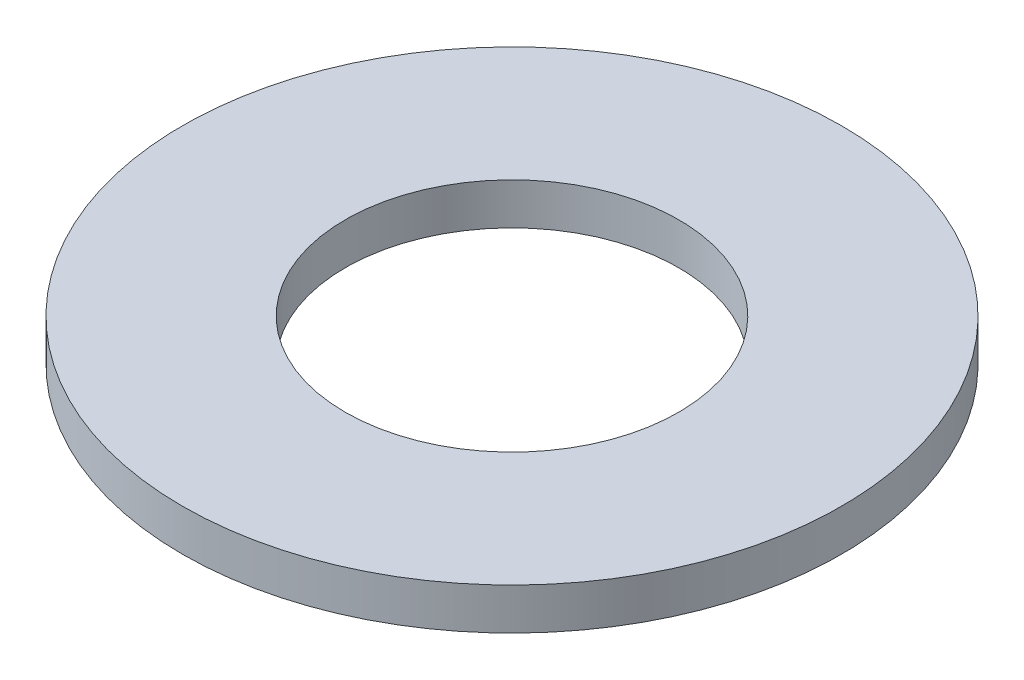
ISO-10303-21;
HEADER;
FILE_DESCRIPTION(('STEP AP214'),'2;1');
FILE_NAME('part.step','',(''),(''),'','','');
FILE_SCHEMA(('AUTOMOTIVE_DESIGN { 1 0 10303 214 1 1 1 1 }'));
ENDSEC;
DATA;
#1=APPLICATION_CONTEXT('core data for automotive mechanical design processes');
#2=APPLICATION_PROTOCOL_DEFINITION('international standard','automotive_design',2000,#1);
#3=PRODUCT_CONTEXT('',#1,'mechanical');
#4=PRODUCT('Part','Part','',(#3));
#5=PRODUCT_RELATED_PRODUCT_CATEGORY('part','',(#4));
#6=PRODUCT_DEFINITION_FORMATION('','',#4);
#7=PRODUCT_DEFINITION_CONTEXT('part definition',#1,'design');
#8=PRODUCT_DEFINITION('design','',#6,#7);
#9=PRODUCT_DEFINITION_SHAPE('','',#8);
#10=(LENGTH_UNIT() NAMED_UNIT(*) SI_UNIT(.MILLI.,.METRE.));
#11=(NAMED_UNIT(*) PLANE_ANGLE_UNIT() SI_UNIT($,.RADIAN.));
#12=(NAMED_UNIT(*) SI_UNIT($,.STERADIAN.) SOLID_ANGLE_UNIT());
#13=UNCERTAINTY_MEASURE_WITH_UNIT(LENGTH_MEASURE(1.E-05),#10,'distance_accuracy_value','');
#14=(GEOMETRIC_REPRESENTATION_CONTEXT(3) GLOBAL_UNCERTAINTY_ASSIGNED_CONTEXT((#13)) GLOBAL_UNIT_ASSIGNED_CONTEXT((#10,
#11,#12)) REPRESENTATION_CONTEXT('',''));
#15=CARTESIAN_POINT('',(0.,0.,0.));
#16=DIRECTION('',(0.,0.,1.));
#17=DIRECTION('',(1.,0.,0.));
#18=AXIS2_PLACEMENT_3D('',#15,#16,#17);
#19=CARTESIAN_POINT('',(0.,0.8001,0.));
#20=DIRECTION('',(0.,1.,0.));
#21=DIRECTION('',(0.,0.,1.));
#22=AXIS2_PLACEMENT_3D('',#19,#20,#21);
#23=PLANE('',#22);
#24=CARTESIAN_POINT('',(0.,0.8001,0.));
#25=DIRECTION('',(0.,1.,0.));
#26=DIRECTION('',(0.,0.,1.));
#27=AXIS2_PLACEMENT_3D('',#24,#25,#26);
#28=CIRCLE('',#27,12.6746);
#29=CARTESIAN_POINT('',(0.,0.8001,12.6746));
#30=VERTEX_POINT('',#29);
#31=EDGE_CURVE('E10',#30,#30,#28,.T.);
#32=ORIENTED_EDGE('',*,*,#31,.T.);
#33=EDGE_LOOP('',(#32));
#34=FACE_BOUND('',#33,.T.);
#35=CARTESIAN_POINT('',(0.,0.8001,0.));
#36=DIRECTION('',(0.,1.,0.));
#37=DIRECTION('',(0.,0.,1.));
#38=AXIS2_PLACEMENT_3D('',#35,#36,#37);
#39=CIRCLE('',#38,6.4135);
#40=CARTESIAN_POINT('',(0.,0.8001,6.4135));
#41=VERTEX_POINT('',#40);
#42=EDGE_CURVE('E44',#41,#41,#39,.T.);
#43=ORIENTED_EDGE('',*,*,#42,.F.);
#44=EDGE_LOOP('',(#43));
#45=FACE_BOUND('',#44,.T.);
#46=ADVANCED_FACE('F33',(#34,#45),#23,.T.);
#47=CARTESIAN_POINT('',(0.,-0.8001,0.));
#48=DIRECTION('',(0.,1.,0.));
#49=DIRECTION('',(0.,0.,1.));
#50=AXIS2_PLACEMENT_3D('',#47,#48,#49);
#51=PLANE('',#50);
#52=CARTESIAN_POINT('',(0.,-0.8001,0.));
#53=DIRECTION('',(0.,1.,0.));
#54=DIRECTION('',(0.,0.,1.));
#55=AXIS2_PLACEMENT_3D('',#52,#53,#54);
#56=CIRCLE('',#55,12.6746);
#57=CARTESIAN_POINT('',(0.,-0.8001,12.6746));
#58=VERTEX_POINT('',#57);
#59=EDGE_CURVE('E37',#58,#58,#56,.T.);
#60=ORIENTED_EDGE('',*,*,#59,.F.);
#61=EDGE_LOOP('',(#60));
#62=FACE_BOUND('',#61,.T.);
#63=CARTESIAN_POINT('',(0.,-0.8001,0.));
#64=DIRECTION('',(0.,1.,0.));
#65=DIRECTION('',(0.,0.,1.));
#66=AXIS2_PLACEMENT_3D('',#63,#64,#65);
#67=CIRCLE('',#66,6.4135);
#68=CARTESIAN_POINT('',(0.,-0.8001,6.4135));
#69=VERTEX_POINT('',#68);
#70=EDGE_CURVE('E46',#69,#69,#67,.T.);
#71=ORIENTED_EDGE('',*,*,#70,.T.);
#72=EDGE_LOOP('',(#71));
#73=FACE_BOUND('',#72,.T.);
#74=ADVANCED_FACE('F56',(#62,#73),#51,.F.);
#75=CARTESIAN_POINT('',(0.,0.8001,0.));
#76=DIRECTION('',(0.,-1.,0.));
#77=DIRECTION('',(0.,0.,-1.));
#78=AXIS2_PLACEMENT_3D('',#75,#76,#77);
#79=CYLINDRICAL_SURFACE('',#78,12.6746);
#80=ORIENTED_EDGE('',*,*,#31,.F.);
#81=EDGE_LOOP('',(#80));
#82=FACE_BOUND('',#81,.T.);
#83=ORIENTED_EDGE('',*,*,#59,.T.);
#84=EDGE_LOOP('',(#83));
#85=FACE_BOUND('',#84,.T.);
#86=ADVANCED_FACE('F35',(#82,#85),#79,.T.);
#87=CARTESIAN_POINT('',(0.,0.8001,0.));
#88=DIRECTION('',(0.,-1.,0.));
#89=DIRECTION('',(0.,0.,-1.));
#90=AXIS2_PLACEMENT_3D('',#87,#88,#89);
#91=CYLINDRICAL_SURFACE('',#90,6.4135);
#92=ORIENTED_EDGE('',*,*,#42,.T.);
#93=EDGE_LOOP('',(#92));
#94=FACE_BOUND('',#93,.T.);
#95=ORIENTED_EDGE('',*,*,#70,.F.);
#96=EDGE_LOOP('',(#95));
#97=FACE_BOUND('',#96,.T.);
#98=ADVANCED_FACE('F52',(#94,#97),#91,.F.);
#99=CLOSED_SHELL('',(#46,#74,#86,#98));
#100=MANIFOLD_SOLID_BREP('B2',#99);
#101=ADVANCED_BREP_SHAPE_REPRESENTATION('',(#18,#100),#14);
#102=SHAPE_DEFINITION_REPRESENTATION(#9,#101);
ENDSEC;
END-ISO-10303-21;
